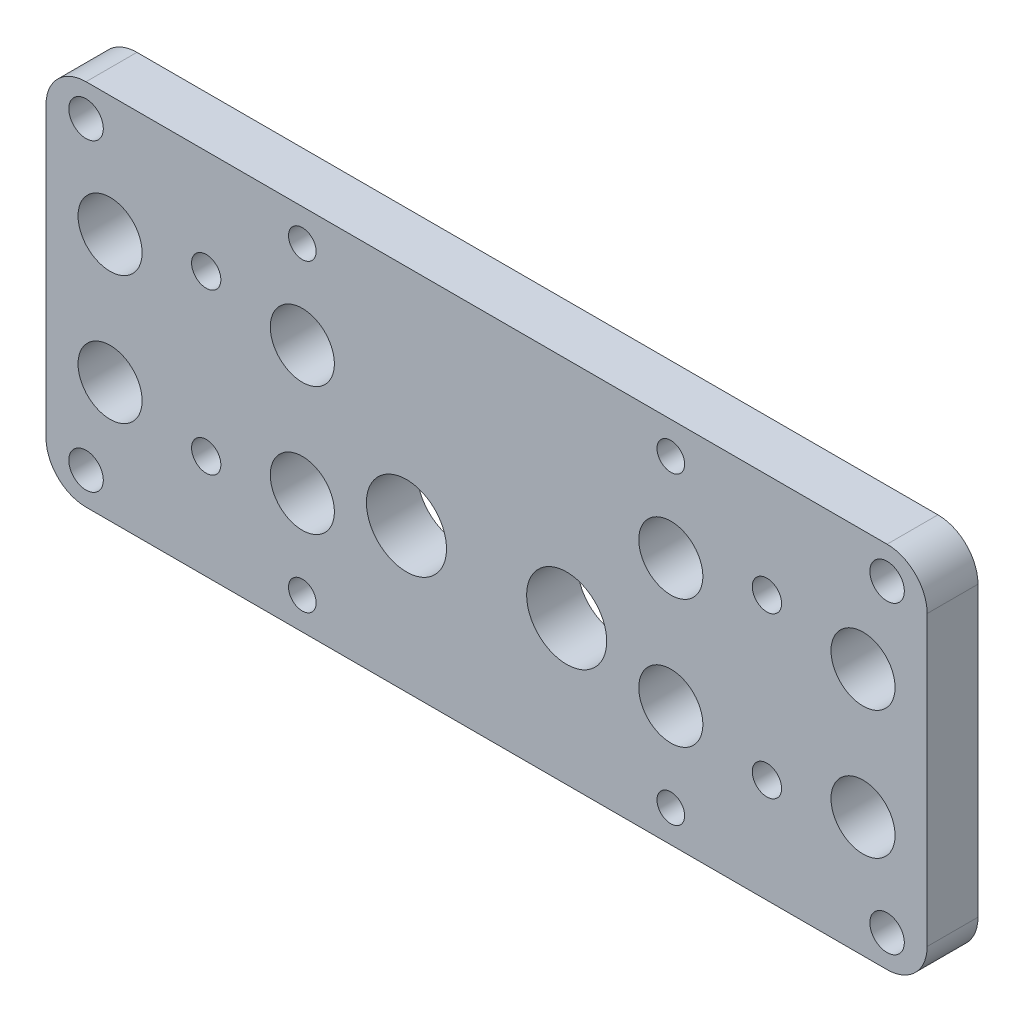
ISO-10303-21;
HEADER;
FILE_DESCRIPTION(('STEP AP214'),'2;1');
FILE_NAME('part.step','',(''),(''),'','','');
FILE_SCHEMA(('AUTOMOTIVE_DESIGN { 1 0 10303 214 1 1 1 1 }'));
ENDSEC;
DATA;
#1=APPLICATION_CONTEXT('core data for automotive mechanical design processes');
#2=APPLICATION_PROTOCOL_DEFINITION('international standard','automotive_design',2000,#1);
#3=PRODUCT_CONTEXT('',#1,'mechanical');
#4=PRODUCT('Part','Part','',(#3));
#5=PRODUCT_RELATED_PRODUCT_CATEGORY('part','',(#4));
#6=PRODUCT_DEFINITION_FORMATION('','',#4);
#7=PRODUCT_DEFINITION_CONTEXT('part definition',#1,'design');
#8=PRODUCT_DEFINITION('design','',#6,#7);
#9=PRODUCT_DEFINITION_SHAPE('','',#8);
#10=(LENGTH_UNIT() NAMED_UNIT(*) SI_UNIT(.MILLI.,.METRE.));
#11=(NAMED_UNIT(*) PLANE_ANGLE_UNIT() SI_UNIT($,.RADIAN.));
#12=(NAMED_UNIT(*) SI_UNIT($,.STERADIAN.) SOLID_ANGLE_UNIT());
#13=UNCERTAINTY_MEASURE_WITH_UNIT(LENGTH_MEASURE(1.E-05),#10,'distance_accuracy_value','');
#14=(GEOMETRIC_REPRESENTATION_CONTEXT(3) GLOBAL_UNCERTAINTY_ASSIGNED_CONTEXT((#13)) GLOBAL_UNIT_ASSIGNED_CONTEXT((#10,
#11,#12)) REPRESENTATION_CONTEXT('',''));
#15=CARTESIAN_POINT('',(0.,0.,0.));
#16=DIRECTION('',(0.,0.,1.));
#17=DIRECTION('',(1.,0.,0.));
#18=AXIS2_PLACEMENT_3D('',#15,#16,#17);
#19=CARTESIAN_POINT('',(0.,0.,0.));
#20=DIRECTION('',(0.,0.,1.));
#21=DIRECTION('',(1.,0.,0.));
#22=AXIS2_PLACEMENT_3D('',#19,#20,#21);
#23=PLANE('',#22);
#24=CARTESIAN_POINT('',(35.,-10.,0.));
#25=DIRECTION('',(0.,0.,-1.));
#26=DIRECTION('',(-1.,0.,0.));
#27=AXIS2_PLACEMENT_3D('',#24,#25,#26);
#28=CIRCLE('',#27,1.82879999999998);
#29=CARTESIAN_POINT('',(33.1712,-10.,0.));
#30=VERTEX_POINT('',#29);
#31=EDGE_CURVE('E295',#30,#30,#28,.T.);
#32=ORIENTED_EDGE('',*,*,#31,.F.);
#33=EDGE_LOOP('',(#32));
#34=FACE_BOUND('',#33,.T.);
#35=CARTESIAN_POINT('',(-35.,-10.,0.));
#36=DIRECTION('',(0.,0.,-1.));
#37=DIRECTION('',(-1.,0.,0.));
#38=AXIS2_PLACEMENT_3D('',#35,#36,#37);
#39=CIRCLE('',#38,1.82879999999998);
#40=CARTESIAN_POINT('',(-36.8288,-10.,0.));
#41=VERTEX_POINT('',#40);
#42=EDGE_CURVE('E289',#41,#41,#39,.T.);
#43=ORIENTED_EDGE('',*,*,#42,.F.);
#44=EDGE_LOOP('',(#43));
#45=FACE_BOUND('',#44,.T.);
#46=CARTESIAN_POINT('',(50.,-19.,0.));
#47=DIRECTION('',(0.,0.,-1.));
#48=DIRECTION('',(-1.,0.,0.));
#49=AXIS2_PLACEMENT_3D('',#46,#47,#48);
#50=CIRCLE('',#49,2.15265);
#51=CARTESIAN_POINT('',(47.84735,-19.,0.));
#52=VERTEX_POINT('',#51);
#53=EDGE_CURVE('E271',#52,#52,#50,.T.);
#54=ORIENTED_EDGE('',*,*,#53,.F.);
#55=EDGE_LOOP('',(#54));
#56=FACE_BOUND('',#55,.T.);
#57=CARTESIAN_POINT('',(-50.,19.,0.));
#58=DIRECTION('',(0.,0.,-1.));
#59=DIRECTION('',(-1.,0.,0.));
#60=AXIS2_PLACEMENT_3D('',#57,#58,#59);
#61=CIRCLE('',#60,2.15265);
#62=CARTESIAN_POINT('',(-52.15265,19.,0.));
#63=VERTEX_POINT('',#62);
#64=EDGE_CURVE('E259',#63,#63,#61,.T.);
#65=ORIENTED_EDGE('',*,*,#64,.F.);
#66=EDGE_LOOP('',(#65));
#67=FACE_BOUND('',#66,.T.);
#68=CARTESIAN_POINT('',(23.,19.,0.));
#69=DIRECTION('',(0.,0.,-1.));
#70=DIRECTION('',(-1.,0.,0.));
#71=AXIS2_PLACEMENT_3D('',#68,#69,#70);
#72=CIRCLE('',#71,1.72719999999999);
#73=CARTESIAN_POINT('',(21.2728,19.,0.));
#74=VERTEX_POINT('',#73);
#75=EDGE_CURVE('E253',#74,#74,#72,.T.);
#76=ORIENTED_EDGE('',*,*,#75,.F.);
#77=EDGE_LOOP('',(#76));
#78=FACE_BOUND('',#77,.T.);
#79=CARTESIAN_POINT('',(-23.,19.,0.));
#80=DIRECTION('',(0.,0.,-1.));
#81=DIRECTION('',(-1.,0.,0.));
#82=AXIS2_PLACEMENT_3D('',#79,#80,#81);
#83=CIRCLE('',#82,1.72719999999999);
#84=CARTESIAN_POINT('',(-24.7272,19.,0.));
#85=VERTEX_POINT('',#84);
#86=EDGE_CURVE('E247',#85,#85,#83,.T.);
#87=ORIENTED_EDGE('',*,*,#86,.F.);
#88=EDGE_LOOP('',(#87));
#89=FACE_BOUND('',#88,.T.);
#90=CARTESIAN_POINT('',(-23.,-19.,0.));
#91=DIRECTION('',(0.,0.,-1.));
#92=DIRECTION('',(-1.,0.,0.));
#93=AXIS2_PLACEMENT_3D('',#90,#91,#92);
#94=CIRCLE('',#93,1.72719999999999);
#95=CARTESIAN_POINT('',(-24.7272,-19.,0.));
#96=VERTEX_POINT('',#95);
#97=EDGE_CURVE('E241',#96,#96,#94,.T.);
#98=ORIENTED_EDGE('',*,*,#97,.F.);
#99=EDGE_LOOP('',(#98));
#100=FACE_BOUND('',#99,.T.);
#101=CARTESIAN_POINT('',(23.,-19.,0.));
#102=DIRECTION('',(0.,0.,-1.));
#103=DIRECTION('',(-1.,0.,0.));
#104=AXIS2_PLACEMENT_3D('',#101,#102,#103);
#105=CIRCLE('',#104,1.72719999999999);
#106=CARTESIAN_POINT('',(21.2728,-19.,0.));
#107=VERTEX_POINT('',#106);
#108=EDGE_CURVE('E235',#107,#107,#105,.T.);
#109=ORIENTED_EDGE('',*,*,#108,.F.);
#110=EDGE_LOOP('',(#109));
#111=FACE_BOUND('',#110,.T.);
#112=CARTESIAN_POINT('',(47.,8.,0.));
#113=DIRECTION('',(0.,0.,-1.));
#114=DIRECTION('',(-1.,0.,0.));
#115=AXIS2_PLACEMENT_3D('',#112,#113,#114);
#116=CIRCLE('',#115,4.00000000000001);
#117=CARTESIAN_POINT('',(43.,8.,0.));
#118=VERTEX_POINT('',#117);
#119=EDGE_CURVE('E227',#118,#118,#116,.T.);
#120=ORIENTED_EDGE('',*,*,#119,.F.);
#121=EDGE_LOOP('',(#120));
#122=FACE_BOUND('',#121,.T.);
#123=CARTESIAN_POINT('',(-47.,-8.,0.));
#124=DIRECTION('',(0.,0.,-1.));
#125=DIRECTION('',(-1.,0.,0.));
#126=AXIS2_PLACEMENT_3D('',#123,#124,#125);
#127=CIRCLE('',#126,4.00000000000001);
#128=CARTESIAN_POINT('',(-51.,-8.,0.));
#129=VERTEX_POINT('',#128);
#130=EDGE_CURVE('E221',#129,#129,#127,.T.);
#131=ORIENTED_EDGE('',*,*,#130,.F.);
#132=EDGE_LOOP('',(#131));
#133=FACE_BOUND('',#132,.T.);
#134=CARTESIAN_POINT('',(-47.,8.,0.));
#135=DIRECTION('',(0.,0.,-1.));
#136=DIRECTION('',(-1.,0.,0.));
#137=AXIS2_PLACEMENT_3D('',#134,#135,#136);
#138=CIRCLE('',#137,4.00000000000001);
#139=CARTESIAN_POINT('',(-51.,8.,0.));
#140=VERTEX_POINT('',#139);
#141=EDGE_CURVE('E215',#140,#140,#138,.T.);
#142=ORIENTED_EDGE('',*,*,#141,.F.);
#143=EDGE_LOOP('',(#142));
#144=FACE_BOUND('',#143,.T.);
#145=CARTESIAN_POINT('',(47.,-8.,0.));
#146=DIRECTION('',(0.,0.,-1.));
#147=DIRECTION('',(-1.,0.,0.));
#148=AXIS2_PLACEMENT_3D('',#145,#146,#147);
#149=CIRCLE('',#148,4.00000000000001);
#150=CARTESIAN_POINT('',(43.,-8.,0.));
#151=VERTEX_POINT('',#150);
#152=EDGE_CURVE('E209',#151,#151,#149,.T.);
#153=ORIENTED_EDGE('',*,*,#152,.F.);
#154=EDGE_LOOP('',(#153));
#155=FACE_BOUND('',#154,.T.);
#156=CARTESIAN_POINT('',(-23.,8.,0.));
#157=DIRECTION('',(0.,0.,-1.));
#158=DIRECTION('',(-1.,0.,0.));
#159=AXIS2_PLACEMENT_3D('',#156,#157,#158);
#160=CIRCLE('',#159,4.);
#161=CARTESIAN_POINT('',(-27.,8.,0.));
#162=VERTEX_POINT('',#161);
#163=EDGE_CURVE('E203',#162,#162,#160,.T.);
#164=ORIENTED_EDGE('',*,*,#163,.F.);
#165=EDGE_LOOP('',(#164));
#166=FACE_BOUND('',#165,.T.);
#167=CARTESIAN_POINT('',(-23.,-8.,0.));
#168=DIRECTION('',(0.,0.,-1.));
#169=DIRECTION('',(-1.,0.,0.));
#170=AXIS2_PLACEMENT_3D('',#167,#168,#169);
#171=CIRCLE('',#170,4.);
#172=CARTESIAN_POINT('',(-27.,-8.,0.));
#173=VERTEX_POINT('',#172);
#174=EDGE_CURVE('E197',#173,#173,#171,.T.);
#175=ORIENTED_EDGE('',*,*,#174,.F.);
#176=EDGE_LOOP('',(#175));
#177=FACE_BOUND('',#176,.T.);
#178=CARTESIAN_POINT('',(23.,-8.,0.));
#179=DIRECTION('',(0.,0.,-1.));
#180=DIRECTION('',(-1.,0.,0.));
#181=AXIS2_PLACEMENT_3D('',#178,#179,#180);
#182=CIRCLE('',#181,4.);
#183=CARTESIAN_POINT('',(19.,-8.,0.));
#184=VERTEX_POINT('',#183);
#185=EDGE_CURVE('E191',#184,#184,#182,.T.);
#186=ORIENTED_EDGE('',*,*,#185,.F.);
#187=EDGE_LOOP('',(#186));
#188=FACE_BOUND('',#187,.T.);
#189=CARTESIAN_POINT('',(23.,8.,0.));
#190=DIRECTION('',(0.,0.,-1.));
#191=DIRECTION('',(-1.,0.,0.));
#192=AXIS2_PLACEMENT_3D('',#189,#190,#191);
#193=CIRCLE('',#192,4.);
#194=CARTESIAN_POINT('',(19.,8.,0.));
#195=VERTEX_POINT('',#194);
#196=EDGE_CURVE('E185',#195,#195,#193,.T.);
#197=ORIENTED_EDGE('',*,*,#196,.F.);
#198=EDGE_LOOP('',(#197));
#199=FACE_BOUND('',#198,.T.);
#200=CARTESIAN_POINT('',(-10.,-5.,0.));
#201=DIRECTION('',(0.,0.,-1.));
#202=DIRECTION('',(-1.,0.,0.));
#203=AXIS2_PLACEMENT_3D('',#200,#201,#202);
#204=CIRCLE('',#203,5.);
#205=CARTESIAN_POINT('',(-15.,-5.,0.));
#206=VERTEX_POINT('',#205);
#207=EDGE_CURVE('E179',#206,#206,#204,.T.);
#208=ORIENTED_EDGE('',*,*,#207,.F.);
#209=EDGE_LOOP('',(#208));
#210=FACE_BOUND('',#209,.T.);
#211=CARTESIAN_POINT('',(10.,-5.,0.));
#212=DIRECTION('',(0.,0.,-1.));
#213=DIRECTION('',(-1.,0.,0.));
#214=AXIS2_PLACEMENT_3D('',#211,#212,#213);
#215=CIRCLE('',#214,5.);
#216=CARTESIAN_POINT('',(5.,-5.,0.));
#217=VERTEX_POINT('',#216);
#218=EDGE_CURVE('E168',#217,#217,#215,.T.);
#219=ORIENTED_EDGE('',*,*,#218,.F.);
#220=EDGE_LOOP('',(#219));
#221=FACE_BOUND('',#220,.T.);
#222=DIRECTION('',(0.,-1.,0.));
#223=VECTOR('',#222,1.);
#224=CARTESIAN_POINT('',(-55.,-23.,0.));
#225=LINE('',#224,#223);
#226=CARTESIAN_POINT('',(-55.,18.,0.));
#227=VERTEX_POINT('',#226);
#228=CARTESIAN_POINT('',(-55.,-18.,0.));
#229=VERTEX_POINT('',#228);
#230=EDGE_CURVE('E118',#227,#229,#225,.T.);
#231=ORIENTED_EDGE('',*,*,#230,.F.);
#232=CARTESIAN_POINT('',(-50.,18.,0.));
#233=DIRECTION('',(0.,0.,1.));
#234=DIRECTION('',(1.,0.,0.));
#235=AXIS2_PLACEMENT_3D('',#232,#233,#234);
#236=CIRCLE('',#235,5.);
#237=CARTESIAN_POINT('',(-50.,23.,0.));
#238=VERTEX_POINT('',#237);
#239=EDGE_CURVE('E101',#227,#238,#236,.F.);
#240=ORIENTED_EDGE('',*,*,#239,.T.);
#241=DIRECTION('',(-1.,0.,0.));
#242=VECTOR('',#241,1.);
#243=CARTESIAN_POINT('',(-55.,23.,0.));
#244=LINE('',#243,#242);
#245=CARTESIAN_POINT('',(50.,23.,0.));
#246=VERTEX_POINT('',#245);
#247=EDGE_CURVE('E128',#246,#238,#244,.T.);
#248=ORIENTED_EDGE('',*,*,#247,.F.);
#249=CARTESIAN_POINT('',(50.,18.,0.));
#250=DIRECTION('',(0.,0.,1.));
#251=DIRECTION('',(1.,0.,0.));
#252=AXIS2_PLACEMENT_3D('',#249,#250,#251);
#253=CIRCLE('',#252,5.);
#254=CARTESIAN_POINT('',(55.,18.,0.));
#255=VERTEX_POINT('',#254);
#256=EDGE_CURVE('E122',#246,#255,#253,.F.);
#257=ORIENTED_EDGE('',*,*,#256,.T.);
#258=DIRECTION('',(0.,1.,0.));
#259=VECTOR('',#258,1.);
#260=CARTESIAN_POINT('',(55.,-23.,0.));
#261=LINE('',#260,#259);
#262=CARTESIAN_POINT('',(55.,-18.,0.));
#263=VERTEX_POINT('',#262);
#264=EDGE_CURVE('E132',#263,#255,#261,.T.);
#265=ORIENTED_EDGE('',*,*,#264,.F.);
#266=CARTESIAN_POINT('',(50.,-18.,0.));
#267=DIRECTION('',(0.,0.,1.));
#268=DIRECTION('',(1.,0.,0.));
#269=AXIS2_PLACEMENT_3D('',#266,#267,#268);
#270=CIRCLE('',#269,5.);
#271=CARTESIAN_POINT('',(50.,-23.,0.));
#272=VERTEX_POINT('',#271);
#273=EDGE_CURVE('E138',#263,#272,#270,.F.);
#274=ORIENTED_EDGE('',*,*,#273,.T.);
#275=DIRECTION('',(1.,0.,0.));
#276=VECTOR('',#275,1.);
#277=CARTESIAN_POINT('',(-55.,-23.,0.));
#278=LINE('',#277,#276);
#279=CARTESIAN_POINT('',(-50.,-23.,0.));
#280=VERTEX_POINT('',#279);
#281=EDGE_CURVE('E160',#280,#272,#278,.T.);
#282=ORIENTED_EDGE('',*,*,#281,.F.);
#283=CARTESIAN_POINT('',(-50.,-18.,0.));
#284=DIRECTION('',(0.,0.,1.));
#285=DIRECTION('',(1.,0.,0.));
#286=AXIS2_PLACEMENT_3D('',#283,#284,#285);
#287=CIRCLE('',#286,5.);
#288=EDGE_CURVE('E112',#280,#229,#287,.F.);
#289=ORIENTED_EDGE('',*,*,#288,.T.);
#290=EDGE_LOOP('',(#231,#240,#248,#257,#265,#274,#282,#289));
#291=FACE_BOUND('',#290,.T.);
#292=CARTESIAN_POINT('',(-50.,-19.,0.));
#293=DIRECTION('',(0.,0.,-1.));
#294=DIRECTION('',(-1.,0.,0.));
#295=AXIS2_PLACEMENT_3D('',#292,#293,#294);
#296=CIRCLE('',#295,2.15265);
#297=CARTESIAN_POINT('',(-52.15265,-19.,0.));
#298=VERTEX_POINT('',#297);
#299=EDGE_CURVE('E265',#298,#298,#296,.T.);
#300=ORIENTED_EDGE('',*,*,#299,.F.);
#301=EDGE_LOOP('',(#300));
#302=FACE_BOUND('',#301,.T.);
#303=CARTESIAN_POINT('',(50.,19.,0.));
#304=DIRECTION('',(0.,0.,-1.));
#305=DIRECTION('',(-1.,0.,0.));
#306=AXIS2_PLACEMENT_3D('',#303,#304,#305);
#307=CIRCLE('',#306,2.15265);
#308=CARTESIAN_POINT('',(47.84735,19.,0.));
#309=VERTEX_POINT('',#308);
#310=EDGE_CURVE('E277',#309,#309,#307,.T.);
#311=ORIENTED_EDGE('',*,*,#310,.F.);
#312=EDGE_LOOP('',(#311));
#313=FACE_BOUND('',#312,.T.);
#314=CARTESIAN_POINT('',(-35.,10.,0.));
#315=DIRECTION('',(0.,0.,-1.));
#316=DIRECTION('',(-1.,0.,0.));
#317=AXIS2_PLACEMENT_3D('',#314,#315,#316);
#318=CIRCLE('',#317,1.82879999999998);
#319=CARTESIAN_POINT('',(-36.8288,10.,0.));
#320=VERTEX_POINT('',#319);
#321=EDGE_CURVE('E283',#320,#320,#318,.T.);
#322=ORIENTED_EDGE('',*,*,#321,.F.);
#323=EDGE_LOOP('',(#322));
#324=FACE_BOUND('',#323,.T.);
#325=CARTESIAN_POINT('',(35.,10.,0.));
#326=DIRECTION('',(0.,0.,-1.));
#327=DIRECTION('',(-1.,0.,0.));
#328=AXIS2_PLACEMENT_3D('',#325,#326,#327);
#329=CIRCLE('',#328,1.82879999999998);
#330=CARTESIAN_POINT('',(33.1712,10.,0.));
#331=VERTEX_POINT('',#330);
#332=EDGE_CURVE('E301',#331,#331,#329,.T.);
#333=ORIENTED_EDGE('',*,*,#332,.F.);
#334=EDGE_LOOP('',(#333));
#335=FACE_BOUND('',#334,.T.);
#336=ADVANCED_FACE('F35',(#34,#45,#56,#67,#78,#89,#100,#111,#122,#133,#144,#155,#166,#177,#188,
#199,#210,#221,#291,#302,#313,#324,#335),#23,.F.);
#337=CARTESIAN_POINT('',(0.,0.,6.35));
#338=DIRECTION('',(0.,0.,1.));
#339=DIRECTION('',(1.,0.,0.));
#340=AXIS2_PLACEMENT_3D('',#337,#338,#339);
#341=PLANE('',#340);
#342=CARTESIAN_POINT('',(35.,10.,6.34999999999999));
#343=DIRECTION('',(0.,0.,-1.));
#344=DIRECTION('',(-1.,0.,0.));
#345=AXIS2_PLACEMENT_3D('',#342,#343,#344);
#346=CIRCLE('',#345,1.82879999999998);
#347=CARTESIAN_POINT('',(33.1712,10.,6.34999999999999));
#348=VERTEX_POINT('',#347);
#349=EDGE_CURVE('E298',#348,#348,#346,.T.);
#350=ORIENTED_EDGE('',*,*,#349,.T.);
#351=EDGE_LOOP('',(#350));
#352=FACE_BOUND('',#351,.T.);
#353=CARTESIAN_POINT('',(35.,-10.,6.34999999999999));
#354=DIRECTION('',(0.,0.,-1.));
#355=DIRECTION('',(-1.,0.,0.));
#356=AXIS2_PLACEMENT_3D('',#353,#354,#355);
#357=CIRCLE('',#356,1.82879999999998);
#358=CARTESIAN_POINT('',(33.1712,-10.,6.34999999999999));
#359=VERTEX_POINT('',#358);
#360=EDGE_CURVE('E292',#359,#359,#357,.T.);
#361=ORIENTED_EDGE('',*,*,#360,.T.);
#362=EDGE_LOOP('',(#361));
#363=FACE_BOUND('',#362,.T.);
#364=CARTESIAN_POINT('',(-35.,-10.,6.34999999999999));
#365=DIRECTION('',(0.,0.,-1.));
#366=DIRECTION('',(-1.,0.,0.));
#367=AXIS2_PLACEMENT_3D('',#364,#365,#366);
#368=CIRCLE('',#367,1.82879999999998);
#369=CARTESIAN_POINT('',(-36.8288,-10.,6.34999999999999));
#370=VERTEX_POINT('',#369);
#371=EDGE_CURVE('E286',#370,#370,#368,.T.);
#372=ORIENTED_EDGE('',*,*,#371,.T.);
#373=EDGE_LOOP('',(#372));
#374=FACE_BOUND('',#373,.T.);
#375=DIRECTION('',(-1.,0.,0.));
#376=VECTOR('',#375,1.);
#377=CARTESIAN_POINT('',(-55.,23.,6.35));
#378=LINE('',#377,#376);
#379=CARTESIAN_POINT('',(50.,23.,6.35));
#380=VERTEX_POINT('',#379);
#381=CARTESIAN_POINT('',(-50.,23.,6.35));
#382=VERTEX_POINT('',#381);
#383=EDGE_CURVE('E172',#380,#382,#378,.T.);
#384=ORIENTED_EDGE('',*,*,#383,.T.);
#385=CARTESIAN_POINT('',(-50.,18.,6.35));
#386=DIRECTION('',(0.,0.,1.));
#387=DIRECTION('',(1.,0.,0.));
#388=AXIS2_PLACEMENT_3D('',#385,#386,#387);
#389=CIRCLE('',#388,5.);
#390=CARTESIAN_POINT('',(-55.,18.,6.35));
#391=VERTEX_POINT('',#390);
#392=EDGE_CURVE('E149',#382,#391,#389,.T.);
#393=ORIENTED_EDGE('',*,*,#392,.T.);
#394=DIRECTION('',(0.,-1.,0.));
#395=VECTOR('',#394,1.);
#396=CARTESIAN_POINT('',(-55.,-23.,6.35));
#397=LINE('',#396,#395);
#398=CARTESIAN_POINT('',(-55.,-18.,6.35));
#399=VERTEX_POINT('',#398);
#400=EDGE_CURVE('E121',#391,#399,#397,.T.);
#401=ORIENTED_EDGE('',*,*,#400,.T.);
#402=CARTESIAN_POINT('',(-50.,-18.,6.35));
#403=DIRECTION('',(0.,0.,1.));
#404=DIRECTION('',(1.,0.,0.));
#405=AXIS2_PLACEMENT_3D('',#402,#403,#404);
#406=CIRCLE('',#405,5.);
#407=CARTESIAN_POINT('',(-50.,-23.,6.35));
#408=VERTEX_POINT('',#407);
#409=EDGE_CURVE('E147',#399,#408,#406,.T.);
#410=ORIENTED_EDGE('',*,*,#409,.T.);
#411=DIRECTION('',(1.,0.,0.));
#412=VECTOR('',#411,1.);
#413=CARTESIAN_POINT('',(-55.,-23.,6.35));
#414=LINE('',#413,#412);
#415=CARTESIAN_POINT('',(50.,-23.,6.35));
#416=VERTEX_POINT('',#415);
#417=EDGE_CURVE('E127',#408,#416,#414,.T.);
#418=ORIENTED_EDGE('',*,*,#417,.T.);
#419=CARTESIAN_POINT('',(50.,-18.,6.35));
#420=DIRECTION('',(0.,0.,1.));
#421=DIRECTION('',(1.,0.,0.));
#422=AXIS2_PLACEMENT_3D('',#419,#420,#421);
#423=CIRCLE('',#422,5.);
#424=CARTESIAN_POINT('',(55.,-18.,6.35));
#425=VERTEX_POINT('',#424);
#426=EDGE_CURVE('E56',#416,#425,#423,.T.);
#427=ORIENTED_EDGE('',*,*,#426,.T.);
#428=DIRECTION('',(0.,1.,0.));
#429=VECTOR('',#428,1.);
#430=CARTESIAN_POINT('',(55.,-23.,6.35));
#431=LINE('',#430,#429);
#432=CARTESIAN_POINT('',(55.,18.,6.35));
#433=VERTEX_POINT('',#432);
#434=EDGE_CURVE('E130',#425,#433,#431,.T.);
#435=ORIENTED_EDGE('',*,*,#434,.T.);
#436=CARTESIAN_POINT('',(50.,18.,6.35));
#437=DIRECTION('',(0.,0.,1.));
#438=DIRECTION('',(1.,0.,0.));
#439=AXIS2_PLACEMENT_3D('',#436,#437,#438);
#440=CIRCLE('',#439,5.);
#441=EDGE_CURVE('E144',#433,#380,#440,.T.);
#442=ORIENTED_EDGE('',*,*,#441,.T.);
#443=EDGE_LOOP('',(#384,#393,#401,#410,#418,#427,#435,#442));
#444=FACE_BOUND('',#443,.T.);
#445=CARTESIAN_POINT('',(10.,-5.,6.35));
#446=DIRECTION('',(0.,0.,-1.));
#447=DIRECTION('',(-1.,0.,0.));
#448=AXIS2_PLACEMENT_3D('',#445,#446,#447);
#449=CIRCLE('',#448,5.);
#450=CARTESIAN_POINT('',(5.,-5.,6.35));
#451=VERTEX_POINT('',#450);
#452=EDGE_CURVE('E165',#451,#451,#449,.T.);
#453=ORIENTED_EDGE('',*,*,#452,.T.);
#454=EDGE_LOOP('',(#453));
#455=FACE_BOUND('',#454,.T.);
#456=CARTESIAN_POINT('',(-10.,-5.,6.35));
#457=DIRECTION('',(0.,0.,-1.));
#458=DIRECTION('',(-1.,0.,0.));
#459=AXIS2_PLACEMENT_3D('',#456,#457,#458);
#460=CIRCLE('',#459,5.);
#461=CARTESIAN_POINT('',(-15.,-5.,6.35));
#462=VERTEX_POINT('',#461);
#463=EDGE_CURVE('E177',#462,#462,#460,.T.);
#464=ORIENTED_EDGE('',*,*,#463,.T.);
#465=EDGE_LOOP('',(#464));
#466=FACE_BOUND('',#465,.T.);
#467=CARTESIAN_POINT('',(23.,8.,6.35));
#468=DIRECTION('',(0.,0.,-1.));
#469=DIRECTION('',(-1.,0.,0.));
#470=AXIS2_PLACEMENT_3D('',#467,#468,#469);
#471=CIRCLE('',#470,4.);
#472=CARTESIAN_POINT('',(19.,8.,6.35));
#473=VERTEX_POINT('',#472);
#474=EDGE_CURVE('E182',#473,#473,#471,.T.);
#475=ORIENTED_EDGE('',*,*,#474,.T.);
#476=EDGE_LOOP('',(#475));
#477=FACE_BOUND('',#476,.T.);
#478=CARTESIAN_POINT('',(23.,-8.,6.35));
#479=DIRECTION('',(0.,0.,-1.));
#480=DIRECTION('',(-1.,0.,0.));
#481=AXIS2_PLACEMENT_3D('',#478,#479,#480);
#482=CIRCLE('',#481,4.);
#483=CARTESIAN_POINT('',(19.,-8.,6.35));
#484=VERTEX_POINT('',#483);
#485=EDGE_CURVE('E188',#484,#484,#482,.T.);
#486=ORIENTED_EDGE('',*,*,#485,.T.);
#487=EDGE_LOOP('',(#486));
#488=FACE_BOUND('',#487,.T.);
#489=CARTESIAN_POINT('',(-23.,-8.,6.35));
#490=DIRECTION('',(0.,0.,-1.));
#491=DIRECTION('',(-1.,0.,0.));
#492=AXIS2_PLACEMENT_3D('',#489,#490,#491);
#493=CIRCLE('',#492,4.);
#494=CARTESIAN_POINT('',(-27.,-8.,6.35));
#495=VERTEX_POINT('',#494);
#496=EDGE_CURVE('E194',#495,#495,#493,.T.);
#497=ORIENTED_EDGE('',*,*,#496,.T.);
#498=EDGE_LOOP('',(#497));
#499=FACE_BOUND('',#498,.T.);
#500=CARTESIAN_POINT('',(-23.,8.,6.35));
#501=DIRECTION('',(0.,0.,-1.));
#502=DIRECTION('',(-1.,0.,0.));
#503=AXIS2_PLACEMENT_3D('',#500,#501,#502);
#504=CIRCLE('',#503,4.);
#505=CARTESIAN_POINT('',(-27.,8.,6.35));
#506=VERTEX_POINT('',#505);
#507=EDGE_CURVE('E200',#506,#506,#504,.T.);
#508=ORIENTED_EDGE('',*,*,#507,.T.);
#509=EDGE_LOOP('',(#508));
#510=FACE_BOUND('',#509,.T.);
#511=CARTESIAN_POINT('',(47.,-8.,6.35));
#512=DIRECTION('',(0.,0.,-1.));
#513=DIRECTION('',(-1.,0.,0.));
#514=AXIS2_PLACEMENT_3D('',#511,#512,#513);
#515=CIRCLE('',#514,4.00000000000001);
#516=CARTESIAN_POINT('',(43.,-8.,6.35));
#517=VERTEX_POINT('',#516);
#518=EDGE_CURVE('E206',#517,#517,#515,.T.);
#519=ORIENTED_EDGE('',*,*,#518,.T.);
#520=EDGE_LOOP('',(#519));
#521=FACE_BOUND('',#520,.T.);
#522=CARTESIAN_POINT('',(-47.,8.,6.35));
#523=DIRECTION('',(0.,0.,-1.));
#524=DIRECTION('',(-1.,0.,0.));
#525=AXIS2_PLACEMENT_3D('',#522,#523,#524);
#526=CIRCLE('',#525,4.00000000000001);
#527=CARTESIAN_POINT('',(-51.,8.,6.35));
#528=VERTEX_POINT('',#527);
#529=EDGE_CURVE('E212',#528,#528,#526,.T.);
#530=ORIENTED_EDGE('',*,*,#529,.T.);
#531=EDGE_LOOP('',(#530));
#532=FACE_BOUND('',#531,.T.);
#533=CARTESIAN_POINT('',(-47.,-8.,6.35));
#534=DIRECTION('',(0.,0.,-1.));
#535=DIRECTION('',(-1.,0.,0.));
#536=AXIS2_PLACEMENT_3D('',#533,#534,#535);
#537=CIRCLE('',#536,4.00000000000001);
#538=CARTESIAN_POINT('',(-51.,-8.,6.35));
#539=VERTEX_POINT('',#538);
#540=EDGE_CURVE('E218',#539,#539,#537,.T.);
#541=ORIENTED_EDGE('',*,*,#540,.T.);
#542=EDGE_LOOP('',(#541));
#543=FACE_BOUND('',#542,.T.);
#544=CARTESIAN_POINT('',(47.,8.,6.35));
#545=DIRECTION('',(0.,0.,-1.));
#546=DIRECTION('',(-1.,0.,0.));
#547=AXIS2_PLACEMENT_3D('',#544,#545,#546);
#548=CIRCLE('',#547,4.00000000000001);
#549=CARTESIAN_POINT('',(43.,8.,6.35));
#550=VERTEX_POINT('',#549);
#551=EDGE_CURVE('E224',#550,#550,#548,.T.);
#552=ORIENTED_EDGE('',*,*,#551,.T.);
#553=EDGE_LOOP('',(#552));
#554=FACE_BOUND('',#553,.T.);
#555=CARTESIAN_POINT('',(23.,-19.,6.34999999999999));
#556=DIRECTION('',(0.,0.,-1.));
#557=DIRECTION('',(-1.,0.,0.));
#558=AXIS2_PLACEMENT_3D('',#555,#556,#557);
#559=CIRCLE('',#558,1.72719999999999);
#560=CARTESIAN_POINT('',(21.2728,-19.,6.34999999999999));
#561=VERTEX_POINT('',#560);
#562=EDGE_CURVE('E230',#561,#561,#559,.T.);
#563=ORIENTED_EDGE('',*,*,#562,.T.);
#564=EDGE_LOOP('',(#563));
#565=FACE_BOUND('',#564,.T.);
#566=CARTESIAN_POINT('',(-23.,-19.,6.34999999999999));
#567=DIRECTION('',(0.,0.,-1.));
#568=DIRECTION('',(-1.,0.,0.));
#569=AXIS2_PLACEMENT_3D('',#566,#567,#568);
#570=CIRCLE('',#569,1.72719999999999);
#571=CARTESIAN_POINT('',(-24.7272,-19.,6.34999999999999));
#572=VERTEX_POINT('',#571);
#573=EDGE_CURVE('E238',#572,#572,#570,.T.);
#574=ORIENTED_EDGE('',*,*,#573,.T.);
#575=EDGE_LOOP('',(#574));
#576=FACE_BOUND('',#575,.T.);
#577=CARTESIAN_POINT('',(-23.,19.,6.34999999999999));
#578=DIRECTION('',(0.,0.,-1.));
#579=DIRECTION('',(-1.,0.,0.));
#580=AXIS2_PLACEMENT_3D('',#577,#578,#579);
#581=CIRCLE('',#580,1.72719999999999);
#582=CARTESIAN_POINT('',(-24.7272,19.,6.34999999999999));
#583=VERTEX_POINT('',#582);
#584=EDGE_CURVE('E244',#583,#583,#581,.T.);
#585=ORIENTED_EDGE('',*,*,#584,.T.);
#586=EDGE_LOOP('',(#585));
#587=FACE_BOUND('',#586,.T.);
#588=CARTESIAN_POINT('',(23.,19.,6.34999999999999));
#589=DIRECTION('',(0.,0.,-1.));
#590=DIRECTION('',(-1.,0.,0.));
#591=AXIS2_PLACEMENT_3D('',#588,#589,#590);
#592=CIRCLE('',#591,1.72719999999999);
#593=CARTESIAN_POINT('',(21.2728,19.,6.34999999999999));
#594=VERTEX_POINT('',#593);
#595=EDGE_CURVE('E250',#594,#594,#592,.T.);
#596=ORIENTED_EDGE('',*,*,#595,.T.);
#597=EDGE_LOOP('',(#596));
#598=FACE_BOUND('',#597,.T.);
#599=CARTESIAN_POINT('',(-50.,19.,6.35));
#600=DIRECTION('',(0.,0.,-1.));
#601=DIRECTION('',(-1.,0.,0.));
#602=AXIS2_PLACEMENT_3D('',#599,#600,#601);
#603=CIRCLE('',#602,2.15265);
#604=CARTESIAN_POINT('',(-52.15265,19.,6.35));
#605=VERTEX_POINT('',#604);
#606=EDGE_CURVE('E256',#605,#605,#603,.T.);
#607=ORIENTED_EDGE('',*,*,#606,.T.);
#608=EDGE_LOOP('',(#607));
#609=FACE_BOUND('',#608,.T.);
#610=CARTESIAN_POINT('',(-50.,-19.,6.35));
#611=DIRECTION('',(0.,0.,-1.));
#612=DIRECTION('',(-1.,0.,0.));
#613=AXIS2_PLACEMENT_3D('',#610,#611,#612);
#614=CIRCLE('',#613,2.15265);
#615=CARTESIAN_POINT('',(-52.15265,-19.,6.35));
#616=VERTEX_POINT('',#615);
#617=EDGE_CURVE('E262',#616,#616,#614,.T.);
#618=ORIENTED_EDGE('',*,*,#617,.T.);
#619=EDGE_LOOP('',(#618));
#620=FACE_BOUND('',#619,.T.);
#621=CARTESIAN_POINT('',(50.,-19.,6.35));
#622=DIRECTION('',(0.,0.,-1.));
#623=DIRECTION('',(-1.,0.,0.));
#624=AXIS2_PLACEMENT_3D('',#621,#622,#623);
#625=CIRCLE('',#624,2.15265);
#626=CARTESIAN_POINT('',(47.84735,-19.,6.35));
#627=VERTEX_POINT('',#626);
#628=EDGE_CURVE('E268',#627,#627,#625,.T.);
#629=ORIENTED_EDGE('',*,*,#628,.T.);
#630=EDGE_LOOP('',(#629));
#631=FACE_BOUND('',#630,.T.);
#632=CARTESIAN_POINT('',(50.,19.,6.35));
#633=DIRECTION('',(0.,0.,-1.));
#634=DIRECTION('',(-1.,0.,0.));
#635=AXIS2_PLACEMENT_3D('',#632,#633,#634);
#636=CIRCLE('',#635,2.15265);
#637=CARTESIAN_POINT('',(47.84735,19.,6.35));
#638=VERTEX_POINT('',#637);
#639=EDGE_CURVE('E274',#638,#638,#636,.T.);
#640=ORIENTED_EDGE('',*,*,#639,.T.);
#641=EDGE_LOOP('',(#640));
#642=FACE_BOUND('',#641,.T.);
#643=CARTESIAN_POINT('',(-35.,10.,6.34999999999999));
#644=DIRECTION('',(0.,0.,-1.));
#645=DIRECTION('',(-1.,0.,0.));
#646=AXIS2_PLACEMENT_3D('',#643,#644,#645);
#647=CIRCLE('',#646,1.82879999999998);
#648=CARTESIAN_POINT('',(-36.8288,10.,6.34999999999999));
#649=VERTEX_POINT('',#648);
#650=EDGE_CURVE('E280',#649,#649,#647,.T.);
#651=ORIENTED_EDGE('',*,*,#650,.T.);
#652=EDGE_LOOP('',(#651));
#653=FACE_BOUND('',#652,.T.);
#654=ADVANCED_FACE('F308',(#352,#363,#374,#444,#455,#466,#477,#488,#499,#510,#521,#532,#543,
#554,#565,#576,#587,#598,#609,#620,#631,#642,#653),#341,.T.);
#655=CARTESIAN_POINT('',(-55.,-23.,6.35));
#656=DIRECTION('',(0.,1.,0.));
#657=DIRECTION('',(-1.,0.,0.));
#658=AXIS2_PLACEMENT_3D('',#655,#656,#657);
#659=PLANE('',#658);
#660=ORIENTED_EDGE('',*,*,#417,.F.);
#661=DIRECTION('',(0.,0.,-1.));
#662=VECTOR('',#661,1.);
#663=CARTESIAN_POINT('',(-50.,-23.,6.35));
#664=LINE('',#663,#662);
#665=EDGE_CURVE('E153',#408,#280,#664,.T.);
#666=ORIENTED_EDGE('',*,*,#665,.T.);
#667=ORIENTED_EDGE('',*,*,#281,.T.);
#668=DIRECTION('',(0.,0.,-1.));
#669=VECTOR('',#668,1.);
#670=CARTESIAN_POINT('',(50.,-23.,6.35));
#671=LINE('',#670,#669);
#672=EDGE_CURVE('E151',#272,#416,#671,.F.);
#673=ORIENTED_EDGE('',*,*,#672,.T.);
#674=EDGE_LOOP('',(#660,#666,#667,#673));
#675=FACE_BOUND('',#674,.T.);
#676=ADVANCED_FACE('F159',(#675),#659,.F.);
#677=CARTESIAN_POINT('',(55.,-23.,6.35));
#678=DIRECTION('',(-1.,0.,0.));
#679=DIRECTION('',(0.,0.,1.));
#680=AXIS2_PLACEMENT_3D('',#677,#678,#679);
#681=PLANE('',#680);
#682=ORIENTED_EDGE('',*,*,#434,.F.);
#683=DIRECTION('',(0.,0.,-1.));
#684=VECTOR('',#683,1.);
#685=CARTESIAN_POINT('',(55.,-18.,6.35));
#686=LINE('',#685,#684);
#687=EDGE_CURVE('E11',#425,#263,#686,.T.);
#688=ORIENTED_EDGE('',*,*,#687,.T.);
#689=ORIENTED_EDGE('',*,*,#264,.T.);
#690=DIRECTION('',(0.,0.,-1.));
#691=VECTOR('',#690,1.);
#692=CARTESIAN_POINT('',(55.,18.,6.35));
#693=LINE('',#692,#691);
#694=EDGE_CURVE('E43',#255,#433,#693,.F.);
#695=ORIENTED_EDGE('',*,*,#694,.T.);
#696=EDGE_LOOP('',(#682,#688,#689,#695));
#697=FACE_BOUND('',#696,.T.);
#698=ADVANCED_FACE('F326',(#697),#681,.F.);
#699=CARTESIAN_POINT('',(-55.,23.,6.35));
#700=DIRECTION('',(0.,-1.,0.));
#701=DIRECTION('',(1.,0.,0.));
#702=AXIS2_PLACEMENT_3D('',#699,#700,#701);
#703=PLANE('',#702);
#704=ORIENTED_EDGE('',*,*,#247,.T.);
#705=DIRECTION('',(0.,0.,-1.));
#706=VECTOR('',#705,1.);
#707=CARTESIAN_POINT('',(-50.,23.,6.35));
#708=LINE('',#707,#706);
#709=EDGE_CURVE('E106',#238,#382,#708,.F.);
#710=ORIENTED_EDGE('',*,*,#709,.T.);
#711=ORIENTED_EDGE('',*,*,#383,.F.);
#712=DIRECTION('',(0.,0.,-1.));
#713=VECTOR('',#712,1.);
#714=CARTESIAN_POINT('',(50.,23.,6.35));
#715=LINE('',#714,#713);
#716=EDGE_CURVE('E111',#380,#246,#715,.T.);
#717=ORIENTED_EDGE('',*,*,#716,.T.);
#718=EDGE_LOOP('',(#704,#710,#711,#717));
#719=FACE_BOUND('',#718,.T.);
#720=ADVANCED_FACE('F323',(#719),#703,.F.);
#721=CARTESIAN_POINT('',(-55.,-23.,6.35));
#722=DIRECTION('',(1.,0.,0.));
#723=DIRECTION('',(0.,0.,-1.));
#724=AXIS2_PLACEMENT_3D('',#721,#722,#723);
#725=PLANE('',#724);
#726=ORIENTED_EDGE('',*,*,#400,.F.);
#727=DIRECTION('',(0.,0.,-1.));
#728=VECTOR('',#727,1.);
#729=CARTESIAN_POINT('',(-55.,18.,6.35));
#730=LINE('',#729,#728);
#731=EDGE_CURVE('E105',#391,#227,#730,.T.);
#732=ORIENTED_EDGE('',*,*,#731,.T.);
#733=ORIENTED_EDGE('',*,*,#230,.T.);
#734=DIRECTION('',(0.,0.,-1.));
#735=VECTOR('',#734,1.);
#736=CARTESIAN_POINT('',(-55.,-18.,6.35));
#737=LINE('',#736,#735);
#738=EDGE_CURVE('E123',#229,#399,#737,.F.);
#739=ORIENTED_EDGE('',*,*,#738,.T.);
#740=EDGE_LOOP('',(#726,#732,#733,#739));
#741=FACE_BOUND('',#740,.T.);
#742=ADVANCED_FACE('F117',(#741),#725,.F.);
#743=CARTESIAN_POINT('',(10.,-5.,6.35));
#744=DIRECTION('',(0.,0.,-1.));
#745=DIRECTION('',(-1.,0.,0.));
#746=AXIS2_PLACEMENT_3D('',#743,#744,#745);
#747=CYLINDRICAL_SURFACE('',#746,5.);
#748=ORIENTED_EDGE('',*,*,#452,.F.);
#749=EDGE_LOOP('',(#748));
#750=FACE_BOUND('',#749,.T.);
#751=ORIENTED_EDGE('',*,*,#218,.T.);
#752=EDGE_LOOP('',(#751));
#753=FACE_BOUND('',#752,.T.);
#754=ADVANCED_FACE('F322',(#750,#753),#747,.F.);
#755=CARTESIAN_POINT('',(-10.,-5.,6.35));
#756=DIRECTION('',(0.,0.,-1.));
#757=DIRECTION('',(-1.,0.,0.));
#758=AXIS2_PLACEMENT_3D('',#755,#756,#757);
#759=CYLINDRICAL_SURFACE('',#758,5.);
#760=ORIENTED_EDGE('',*,*,#463,.F.);
#761=EDGE_LOOP('',(#760));
#762=FACE_BOUND('',#761,.T.);
#763=ORIENTED_EDGE('',*,*,#207,.T.);
#764=EDGE_LOOP('',(#763));
#765=FACE_BOUND('',#764,.T.);
#766=ADVANCED_FACE('F464',(#762,#765),#759,.F.);
#767=CARTESIAN_POINT('',(23.,8.,6.35));
#768=DIRECTION('',(0.,0.,-1.));
#769=DIRECTION('',(-1.,0.,0.));
#770=AXIS2_PLACEMENT_3D('',#767,#768,#769);
#771=CYLINDRICAL_SURFACE('',#770,4.);
#772=ORIENTED_EDGE('',*,*,#474,.F.);
#773=EDGE_LOOP('',(#772));
#774=FACE_BOUND('',#773,.T.);
#775=ORIENTED_EDGE('',*,*,#196,.T.);
#776=EDGE_LOOP('',(#775));
#777=FACE_BOUND('',#776,.T.);
#778=ADVANCED_FACE('F460',(#774,#777),#771,.F.);
#779=CARTESIAN_POINT('',(23.,-8.,6.35));
#780=DIRECTION('',(0.,0.,-1.));
#781=DIRECTION('',(-1.,0.,0.));
#782=AXIS2_PLACEMENT_3D('',#779,#780,#781);
#783=CYLINDRICAL_SURFACE('',#782,4.);
#784=ORIENTED_EDGE('',*,*,#485,.F.);
#785=EDGE_LOOP('',(#784));
#786=FACE_BOUND('',#785,.T.);
#787=ORIENTED_EDGE('',*,*,#185,.T.);
#788=EDGE_LOOP('',(#787));
#789=FACE_BOUND('',#788,.T.);
#790=ADVANCED_FACE('F456',(#786,#789),#783,.F.);
#791=CARTESIAN_POINT('',(-23.,-8.,6.35));
#792=DIRECTION('',(0.,0.,-1.));
#793=DIRECTION('',(-1.,0.,0.));
#794=AXIS2_PLACEMENT_3D('',#791,#792,#793);
#795=CYLINDRICAL_SURFACE('',#794,4.);
#796=ORIENTED_EDGE('',*,*,#496,.F.);
#797=EDGE_LOOP('',(#796));
#798=FACE_BOUND('',#797,.T.);
#799=ORIENTED_EDGE('',*,*,#174,.T.);
#800=EDGE_LOOP('',(#799));
#801=FACE_BOUND('',#800,.T.);
#802=ADVANCED_FACE('F452',(#798,#801),#795,.F.);
#803=CARTESIAN_POINT('',(-23.,8.,6.35));
#804=DIRECTION('',(0.,0.,-1.));
#805=DIRECTION('',(-1.,0.,0.));
#806=AXIS2_PLACEMENT_3D('',#803,#804,#805);
#807=CYLINDRICAL_SURFACE('',#806,4.);
#808=ORIENTED_EDGE('',*,*,#507,.F.);
#809=EDGE_LOOP('',(#808));
#810=FACE_BOUND('',#809,.T.);
#811=ORIENTED_EDGE('',*,*,#163,.T.);
#812=EDGE_LOOP('',(#811));
#813=FACE_BOUND('',#812,.T.);
#814=ADVANCED_FACE('F448',(#810,#813),#807,.F.);
#815=CARTESIAN_POINT('',(47.,-8.,6.35));
#816=DIRECTION('',(0.,0.,-1.));
#817=DIRECTION('',(-1.,0.,0.));
#818=AXIS2_PLACEMENT_3D('',#815,#816,#817);
#819=CYLINDRICAL_SURFACE('',#818,4.00000000000001);
#820=ORIENTED_EDGE('',*,*,#518,.F.);
#821=EDGE_LOOP('',(#820));
#822=FACE_BOUND('',#821,.T.);
#823=ORIENTED_EDGE('',*,*,#152,.T.);
#824=EDGE_LOOP('',(#823));
#825=FACE_BOUND('',#824,.T.);
#826=ADVANCED_FACE('F444',(#822,#825),#819,.F.);
#827=CARTESIAN_POINT('',(-47.,8.,6.35));
#828=DIRECTION('',(0.,0.,-1.));
#829=DIRECTION('',(-1.,0.,0.));
#830=AXIS2_PLACEMENT_3D('',#827,#828,#829);
#831=CYLINDRICAL_SURFACE('',#830,4.00000000000001);
#832=ORIENTED_EDGE('',*,*,#529,.F.);
#833=EDGE_LOOP('',(#832));
#834=FACE_BOUND('',#833,.T.);
#835=ORIENTED_EDGE('',*,*,#141,.T.);
#836=EDGE_LOOP('',(#835));
#837=FACE_BOUND('',#836,.T.);
#838=ADVANCED_FACE('F440',(#834,#837),#831,.F.);
#839=CARTESIAN_POINT('',(-47.,-8.,6.35));
#840=DIRECTION('',(0.,0.,-1.));
#841=DIRECTION('',(-1.,0.,0.));
#842=AXIS2_PLACEMENT_3D('',#839,#840,#841);
#843=CYLINDRICAL_SURFACE('',#842,4.00000000000001);
#844=ORIENTED_EDGE('',*,*,#540,.F.);
#845=EDGE_LOOP('',(#844));
#846=FACE_BOUND('',#845,.T.);
#847=ORIENTED_EDGE('',*,*,#130,.T.);
#848=EDGE_LOOP('',(#847));
#849=FACE_BOUND('',#848,.T.);
#850=ADVANCED_FACE('F436',(#846,#849),#843,.F.);
#851=CARTESIAN_POINT('',(47.,8.,6.35));
#852=DIRECTION('',(0.,0.,-1.));
#853=DIRECTION('',(-1.,0.,0.));
#854=AXIS2_PLACEMENT_3D('',#851,#852,#853);
#855=CYLINDRICAL_SURFACE('',#854,4.00000000000001);
#856=ORIENTED_EDGE('',*,*,#551,.F.);
#857=EDGE_LOOP('',(#856));
#858=FACE_BOUND('',#857,.T.);
#859=ORIENTED_EDGE('',*,*,#119,.T.);
#860=EDGE_LOOP('',(#859));
#861=FACE_BOUND('',#860,.T.);
#862=ADVANCED_FACE('F335',(#858,#861),#855,.F.);
#863=CARTESIAN_POINT('',(-50.,18.,6.35));
#864=DIRECTION('',(0.,0.,-1.));
#865=DIRECTION('',(-1.,0.,0.));
#866=AXIS2_PLACEMENT_3D('',#863,#864,#865);
#867=CYLINDRICAL_SURFACE('',#866,5.);
#868=ORIENTED_EDGE('',*,*,#392,.F.);
#869=ORIENTED_EDGE('',*,*,#709,.F.);
#870=ORIENTED_EDGE('',*,*,#239,.F.);
#871=ORIENTED_EDGE('',*,*,#731,.F.);
#872=EDGE_LOOP('',(#868,#869,#870,#871));
#873=FACE_BOUND('',#872,.T.);
#874=ADVANCED_FACE('F104',(#873),#867,.T.);
#875=CARTESIAN_POINT('',(-50.,-18.,6.35));
#876=DIRECTION('',(0.,0.,-1.));
#877=DIRECTION('',(-1.,0.,0.));
#878=AXIS2_PLACEMENT_3D('',#875,#876,#877);
#879=CYLINDRICAL_SURFACE('',#878,5.);
#880=ORIENTED_EDGE('',*,*,#409,.F.);
#881=ORIENTED_EDGE('',*,*,#738,.F.);
#882=ORIENTED_EDGE('',*,*,#288,.F.);
#883=ORIENTED_EDGE('',*,*,#665,.F.);
#884=EDGE_LOOP('',(#880,#881,#882,#883));
#885=FACE_BOUND('',#884,.T.);
#886=ADVANCED_FACE('F334',(#885),#879,.T.);
#887=CARTESIAN_POINT('',(50.,-18.,6.35));
#888=DIRECTION('',(0.,0.,-1.));
#889=DIRECTION('',(-1.,0.,0.));
#890=AXIS2_PLACEMENT_3D('',#887,#888,#889);
#891=CYLINDRICAL_SURFACE('',#890,5.);
#892=ORIENTED_EDGE('',*,*,#426,.F.);
#893=ORIENTED_EDGE('',*,*,#672,.F.);
#894=ORIENTED_EDGE('',*,*,#273,.F.);
#895=ORIENTED_EDGE('',*,*,#687,.F.);
#896=EDGE_LOOP('',(#892,#893,#894,#895));
#897=FACE_BOUND('',#896,.T.);
#898=ADVANCED_FACE('F337',(#897),#891,.T.);
#899=CARTESIAN_POINT('',(50.,18.,6.35));
#900=DIRECTION('',(0.,0.,-1.));
#901=DIRECTION('',(-1.,0.,0.));
#902=AXIS2_PLACEMENT_3D('',#899,#900,#901);
#903=CYLINDRICAL_SURFACE('',#902,5.);
#904=ORIENTED_EDGE('',*,*,#441,.F.);
#905=ORIENTED_EDGE('',*,*,#694,.F.);
#906=ORIENTED_EDGE('',*,*,#256,.F.);
#907=ORIENTED_EDGE('',*,*,#716,.F.);
#908=EDGE_LOOP('',(#904,#905,#906,#907));
#909=FACE_BOUND('',#908,.T.);
#910=ADVANCED_FACE('F37',(#909),#903,.T.);
#911=CARTESIAN_POINT('',(23.,-19.,0.));
#912=DIRECTION('',(0.,0.,-1.));
#913=DIRECTION('',(-1.,0.,0.));
#914=AXIS2_PLACEMENT_3D('',#911,#912,#913);
#915=CYLINDRICAL_SURFACE('',#914,1.72719999999999);
#916=ORIENTED_EDGE('',*,*,#562,.F.);
#917=EDGE_LOOP('',(#916));
#918=FACE_BOUND('',#917,.T.);
#919=ORIENTED_EDGE('',*,*,#108,.T.);
#920=EDGE_LOOP('',(#919));
#921=FACE_BOUND('',#920,.T.);
#922=ADVANCED_FACE('F343',(#918,#921),#915,.F.);
#923=CARTESIAN_POINT('',(-23.,-19.,0.));
#924=DIRECTION('',(0.,0.,-1.));
#925=DIRECTION('',(-1.,0.,0.));
#926=AXIS2_PLACEMENT_3D('',#923,#924,#925);
#927=CYLINDRICAL_SURFACE('',#926,1.72719999999999);
#928=ORIENTED_EDGE('',*,*,#573,.F.);
#929=EDGE_LOOP('',(#928));
#930=FACE_BOUND('',#929,.T.);
#931=ORIENTED_EDGE('',*,*,#97,.T.);
#932=EDGE_LOOP('',(#931));
#933=FACE_BOUND('',#932,.T.);
#934=ADVANCED_FACE('F426',(#930,#933),#927,.F.);
#935=CARTESIAN_POINT('',(-23.,19.,0.));
#936=DIRECTION('',(0.,0.,-1.));
#937=DIRECTION('',(-1.,0.,0.));
#938=AXIS2_PLACEMENT_3D('',#935,#936,#937);
#939=CYLINDRICAL_SURFACE('',#938,1.72719999999999);
#940=ORIENTED_EDGE('',*,*,#584,.F.);
#941=EDGE_LOOP('',(#940));
#942=FACE_BOUND('',#941,.T.);
#943=ORIENTED_EDGE('',*,*,#86,.T.);
#944=EDGE_LOOP('',(#943));
#945=FACE_BOUND('',#944,.T.);
#946=ADVANCED_FACE('F422',(#942,#945),#939,.F.);
#947=CARTESIAN_POINT('',(23.,19.,0.));
#948=DIRECTION('',(0.,0.,-1.));
#949=DIRECTION('',(-1.,0.,0.));
#950=AXIS2_PLACEMENT_3D('',#947,#948,#949);
#951=CYLINDRICAL_SURFACE('',#950,1.72719999999999);
#952=ORIENTED_EDGE('',*,*,#595,.F.);
#953=EDGE_LOOP('',(#952));
#954=FACE_BOUND('',#953,.T.);
#955=ORIENTED_EDGE('',*,*,#75,.T.);
#956=EDGE_LOOP('',(#955));
#957=FACE_BOUND('',#956,.T.);
#958=ADVANCED_FACE('F418',(#954,#957),#951,.F.);
#959=CARTESIAN_POINT('',(-50.,19.,0.));
#960=DIRECTION('',(0.,0.,-1.));
#961=DIRECTION('',(-1.,0.,0.));
#962=AXIS2_PLACEMENT_3D('',#959,#960,#961);
#963=CYLINDRICAL_SURFACE('',#962,2.15265);
#964=ORIENTED_EDGE('',*,*,#606,.F.);
#965=EDGE_LOOP('',(#964));
#966=FACE_BOUND('',#965,.T.);
#967=ORIENTED_EDGE('',*,*,#64,.T.);
#968=EDGE_LOOP('',(#967));
#969=FACE_BOUND('',#968,.T.);
#970=ADVANCED_FACE('F414',(#966,#969),#963,.F.);
#971=CARTESIAN_POINT('',(-50.,-19.,0.));
#972=DIRECTION('',(0.,0.,-1.));
#973=DIRECTION('',(-1.,0.,0.));
#974=AXIS2_PLACEMENT_3D('',#971,#972,#973);
#975=CYLINDRICAL_SURFACE('',#974,2.15265);
#976=ORIENTED_EDGE('',*,*,#617,.F.);
#977=EDGE_LOOP('',(#976));
#978=FACE_BOUND('',#977,.T.);
#979=ORIENTED_EDGE('',*,*,#299,.T.);
#980=EDGE_LOOP('',(#979));
#981=FACE_BOUND('',#980,.T.);
#982=ADVANCED_FACE('F410',(#978,#981),#975,.F.);
#983=CARTESIAN_POINT('',(50.,-19.,0.));
#984=DIRECTION('',(0.,0.,-1.));
#985=DIRECTION('',(-1.,0.,0.));
#986=AXIS2_PLACEMENT_3D('',#983,#984,#985);
#987=CYLINDRICAL_SURFACE('',#986,2.15265);
#988=ORIENTED_EDGE('',*,*,#628,.F.);
#989=EDGE_LOOP('',(#988));
#990=FACE_BOUND('',#989,.T.);
#991=ORIENTED_EDGE('',*,*,#53,.T.);
#992=EDGE_LOOP('',(#991));
#993=FACE_BOUND('',#992,.T.);
#994=ADVANCED_FACE('F403',(#990,#993),#987,.F.);
#995=CARTESIAN_POINT('',(50.,19.,0.));
#996=DIRECTION('',(0.,0.,-1.));
#997=DIRECTION('',(-1.,0.,0.));
#998=AXIS2_PLACEMENT_3D('',#995,#996,#997);
#999=CYLINDRICAL_SURFACE('',#998,2.15265);
#1000=ORIENTED_EDGE('',*,*,#639,.F.);
#1001=EDGE_LOOP('',(#1000));
#1002=FACE_BOUND('',#1001,.T.);
#1003=ORIENTED_EDGE('',*,*,#310,.T.);
#1004=EDGE_LOOP('',(#1003));
#1005=FACE_BOUND('',#1004,.T.);
#1006=ADVANCED_FACE('F392',(#1002,#1005),#999,.F.);
#1007=CARTESIAN_POINT('',(-35.,10.,0.));
#1008=DIRECTION('',(0.,0.,-1.));
#1009=DIRECTION('',(-1.,0.,0.));
#1010=AXIS2_PLACEMENT_3D('',#1007,#1008,#1009);
#1011=CYLINDRICAL_SURFACE('',#1010,1.82879999999998);
#1012=ORIENTED_EDGE('',*,*,#650,.F.);
#1013=EDGE_LOOP('',(#1012));
#1014=FACE_BOUND('',#1013,.T.);
#1015=ORIENTED_EDGE('',*,*,#321,.T.);
#1016=EDGE_LOOP('',(#1015));
#1017=FACE_BOUND('',#1016,.T.);
#1018=ADVANCED_FACE('F388',(#1014,#1017),#1011,.F.);
#1019=CARTESIAN_POINT('',(-35.,-10.,0.));
#1020=DIRECTION('',(0.,0.,-1.));
#1021=DIRECTION('',(-1.,0.,0.));
#1022=AXIS2_PLACEMENT_3D('',#1019,#1020,#1021);
#1023=CYLINDRICAL_SURFACE('',#1022,1.82879999999998);
#1024=ORIENTED_EDGE('',*,*,#371,.F.);
#1025=EDGE_LOOP('',(#1024));
#1026=FACE_BOUND('',#1025,.T.);
#1027=ORIENTED_EDGE('',*,*,#42,.T.);
#1028=EDGE_LOOP('',(#1027));
#1029=FACE_BOUND('',#1028,.T.);
#1030=ADVANCED_FACE('F391',(#1026,#1029),#1023,.F.);
#1031=CARTESIAN_POINT('',(35.,-10.,0.));
#1032=DIRECTION('',(0.,0.,-1.));
#1033=DIRECTION('',(-1.,0.,0.));
#1034=AXIS2_PLACEMENT_3D('',#1031,#1032,#1033);
#1035=CYLINDRICAL_SURFACE('',#1034,1.82879999999998);
#1036=ORIENTED_EDGE('',*,*,#360,.F.);
#1037=EDGE_LOOP('',(#1036));
#1038=FACE_BOUND('',#1037,.T.);
#1039=ORIENTED_EDGE('',*,*,#31,.T.);
#1040=EDGE_LOOP('',(#1039));
#1041=FACE_BOUND('',#1040,.T.);
#1042=ADVANCED_FACE('F400',(#1038,#1041),#1035,.F.);
#1043=CARTESIAN_POINT('',(35.,10.,0.));
#1044=DIRECTION('',(0.,0.,-1.));
#1045=DIRECTION('',(-1.,0.,0.));
#1046=AXIS2_PLACEMENT_3D('',#1043,#1044,#1045);
#1047=CYLINDRICAL_SURFACE('',#1046,1.82879999999998);
#1048=ORIENTED_EDGE('',*,*,#349,.F.);
#1049=EDGE_LOOP('',(#1048));
#1050=FACE_BOUND('',#1049,.T.);
#1051=ORIENTED_EDGE('',*,*,#332,.T.);
#1052=EDGE_LOOP('',(#1051));
#1053=FACE_BOUND('',#1052,.T.);
#1054=ADVANCED_FACE('F305',(#1050,#1053),#1047,.F.);
#1055=CLOSED_SHELL('',(#336,#654,#676,#698,#720,#742,#754,#766,#778,#790,#802,#814,#826,#838,
#850,#862,#874,#886,#898,#910,#922,#934,#946,#958,#970,#982,#994,#1006,#1018,#1030,#1042,#1054));
#1056=MANIFOLD_SOLID_BREP('B2',#1055);
#1057=ADVANCED_BREP_SHAPE_REPRESENTATION('',(#18,#1056),#14);
#1058=SHAPE_DEFINITION_REPRESENTATION(#9,#1057);
ENDSEC;
END-ISO-10303-21;
